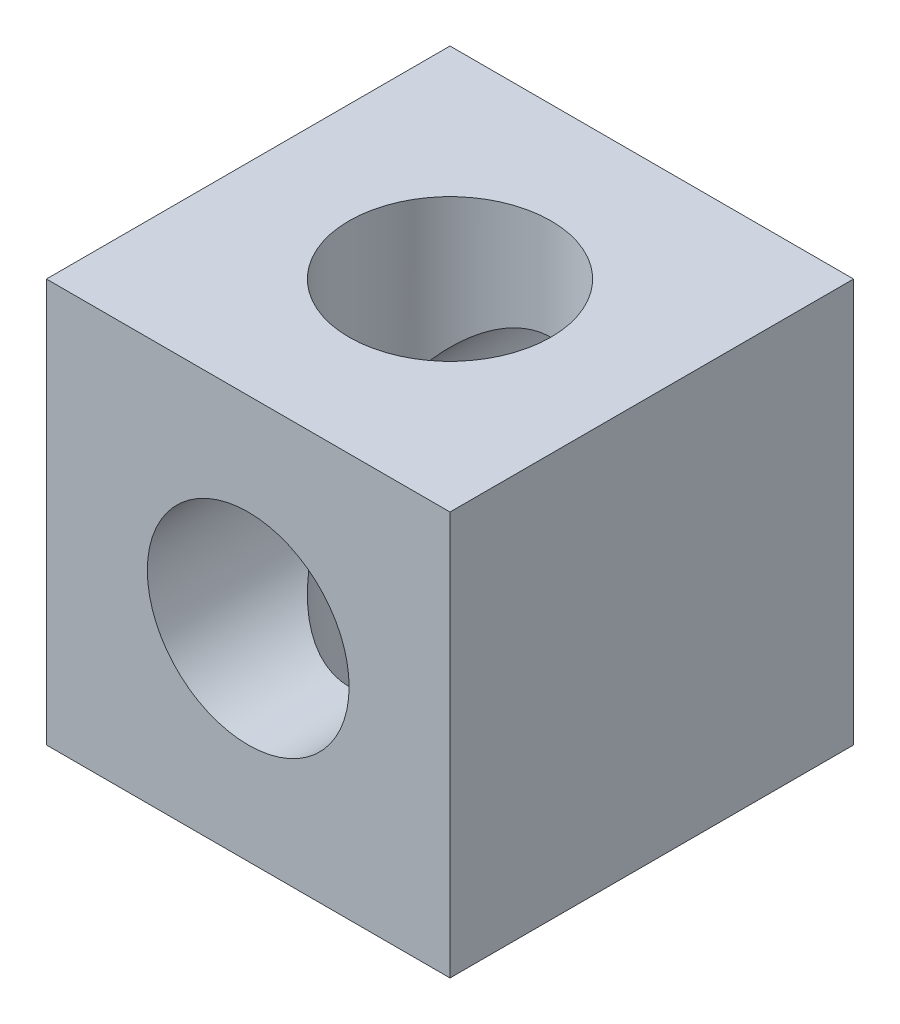
ISO-10303-21;
HEADER;
FILE_DESCRIPTION(('STEP AP214'),'2;1');
FILE_NAME('part.step','',(''),(''),'','','');
FILE_SCHEMA(('AUTOMOTIVE_DESIGN { 1 0 10303 214 1 1 1 1 }'));
ENDSEC;
DATA;
#1=APPLICATION_CONTEXT('core data for automotive mechanical design processes');
#2=APPLICATION_PROTOCOL_DEFINITION('international standard','automotive_design',2000,#1);
#3=PRODUCT_CONTEXT('',#1,'mechanical');
#4=PRODUCT('Part','Part','',(#3));
#5=PRODUCT_RELATED_PRODUCT_CATEGORY('part','',(#4));
#6=PRODUCT_DEFINITION_FORMATION('','',#4);
#7=PRODUCT_DEFINITION_CONTEXT('part definition',#1,'design');
#8=PRODUCT_DEFINITION('design','',#6,#7);
#9=PRODUCT_DEFINITION_SHAPE('','',#8);
#10=(LENGTH_UNIT() NAMED_UNIT(*) SI_UNIT(.MILLI.,.METRE.));
#11=(NAMED_UNIT(*) PLANE_ANGLE_UNIT() SI_UNIT($,.RADIAN.));
#12=(NAMED_UNIT(*) SI_UNIT($,.STERADIAN.) SOLID_ANGLE_UNIT());
#13=UNCERTAINTY_MEASURE_WITH_UNIT(LENGTH_MEASURE(1.E-05),#10,'distance_accuracy_value','');
#14=(GEOMETRIC_REPRESENTATION_CONTEXT(3) GLOBAL_UNCERTAINTY_ASSIGNED_CONTEXT((#13)) GLOBAL_UNIT_ASSIGNED_CONTEXT((#10,
#11,#12)) REPRESENTATION_CONTEXT('',''));
#15=CARTESIAN_POINT('',(0.,0.,0.));
#16=DIRECTION('',(0.,0.,1.));
#17=DIRECTION('',(1.,0.,0.));
#18=AXIS2_PLACEMENT_3D('',#15,#16,#17);
#19=CARTESIAN_POINT('',(4.02455846426619E-12,-3.19189119579733E-13,9.99999999999524));
#20=DIRECTION('',(0.,0.,-1.));
#21=DIRECTION('',(-1.,0.,0.));
#22=AXIS2_PLACEMENT_3D('',#19,#20,#21);
#23=CYLINDRICAL_SURFACE('',#22,2.5);
#24=CARTESIAN_POINT('',(4.44089209850063E-13,0.,4.99999999999606));
#25=DIRECTION('',(0.,0.707106781186548,-0.707106781186552));
#26=DIRECTION('',(0.,-0.707106781186548,-0.707106781186556));
#27=AXIS2_PLACEMENT_3D('',#24,#25,#26);
#28=ELLIPSE('',#27,3.53553390593274,2.5);
#29=CARTESIAN_POINT('',(2.50000000000128,3.33066907387547E-13,4.99999999999606));
#30=VERTEX_POINT('',#29);
#31=CARTESIAN_POINT('',(-2.49999999999792,-1.12410081243297E-12,4.99999999999567));
#32=VERTEX_POINT('',#31);
#33=EDGE_CURVE('E11',#30,#32,#28,.F.);
#34=ORIENTED_EDGE('',*,*,#33,.F.);
#35=CARTESIAN_POINT('',(4.44089209850063E-13,0.,4.99999999999606));
#36=DIRECTION('',(0.,-0.707106781186548,-0.707106781186556));
#37=DIRECTION('',(0.,0.707106781186548,-0.707106781186552));
#38=AXIS2_PLACEMENT_3D('',#35,#36,#37);
#39=ELLIPSE('',#38,3.53553390593274,2.5);
#40=EDGE_CURVE('E30',#32,#30,#39,.F.);
#41=ORIENTED_EDGE('',*,*,#40,.F.);
#42=EDGE_LOOP('',(#34,#41));
#43=FACE_BOUND('',#42,.T.);
#44=CARTESIAN_POINT('',(4.02455846426619E-12,-3.19189119579733E-13,9.99999999999524));
#45=DIRECTION('',(0.,0.,1.));
#46=DIRECTION('',(1.,0.,0.));
#47=AXIS2_PLACEMENT_3D('',#44,#45,#46);
#48=CIRCLE('',#47,2.5);
#49=CARTESIAN_POINT('',(2.50000000000402,-3.26544347117874E-13,9.99999999999524));
#50=VERTEX_POINT('',#49);
#51=EDGE_CURVE('E106',#50,#50,#48,.T.);
#52=ORIENTED_EDGE('',*,*,#51,.T.);
#53=EDGE_LOOP('',(#52));
#54=FACE_BOUND('',#53,.T.);
#55=ADVANCED_FACE('F16',(#43,#54),#23,.F.);
#56=CARTESIAN_POINT('',(-4.99999999999942,-5.00000000000057,9.99999999999634));
#57=DIRECTION('',(0.,0.,-1.));
#58=DIRECTION('',(-1.,0.,0.));
#59=AXIS2_PLACEMENT_3D('',#56,#57,#58);
#60=PLANE('',#59);
#61=DIRECTION('',(0.,-1.,0.));
#62=VECTOR('',#61,1.);
#63=CARTESIAN_POINT('',(-4.99999999999942,-5.00000000000057,9.99999999999634));
#64=LINE('',#63,#62);
#65=CARTESIAN_POINT('',(-4.99999999999984,5.00000000000015,9.99999999999995));
#66=VERTEX_POINT('',#65);
#67=CARTESIAN_POINT('',(-4.99999999999942,-5.00000000000057,9.99999999999634));
#68=VERTEX_POINT('',#67);
#69=EDGE_CURVE('E95',#66,#68,#64,.T.);
#70=ORIENTED_EDGE('',*,*,#69,.T.);
#71=DIRECTION('',(1.,0.,0.));
#72=VECTOR('',#71,1.);
#73=CARTESIAN_POINT('',(-4.99999999999942,-5.00000000000057,9.99999999999634));
#74=LINE('',#73,#72);
#75=CARTESIAN_POINT('',(5.00000000000544,-5.00000000000136,9.99999999999524));
#76=VERTEX_POINT('',#75);
#77=EDGE_CURVE('E93',#68,#76,#74,.T.);
#78=ORIENTED_EDGE('',*,*,#77,.T.);
#79=DIRECTION('',(0.,1.,0.));
#80=VECTOR('',#79,1.);
#81=CARTESIAN_POINT('',(5.00000000000544,-5.00000000000136,9.99999999999524));
#82=LINE('',#81,#80);
#83=CARTESIAN_POINT('',(5.00000000000088,4.99999999999867,9.9999999999984));
#84=VERTEX_POINT('',#83);
#85=EDGE_CURVE('E91',#76,#84,#82,.T.);
#86=ORIENTED_EDGE('',*,*,#85,.T.);
#87=DIRECTION('',(-1.,0.,0.));
#88=VECTOR('',#87,1.);
#89=CARTESIAN_POINT('',(-4.99999999999984,5.00000000000015,9.99999999999995));
#90=LINE('',#89,#88);
#91=EDGE_CURVE('E38',#84,#66,#90,.T.);
#92=ORIENTED_EDGE('',*,*,#91,.T.);
#93=EDGE_LOOP('',(#70,#78,#86,#92));
#94=FACE_BOUND('',#93,.T.);
#95=ORIENTED_EDGE('',*,*,#51,.F.);
#96=EDGE_LOOP('',(#95));
#97=FACE_BOUND('',#96,.T.);
#98=ADVANCED_FACE('F138',(#94,#97),#60,.F.);
#99=CARTESIAN_POINT('',(-4.99999999999634,-5.00000000000129,-6.7168492989822E-12));
#100=DIRECTION('',(0.,0.,-1.));
#101=DIRECTION('',(-1.,0.,0.));
#102=AXIS2_PLACEMENT_3D('',#99,#100,#101);
#103=PLANE('',#102);
#104=DIRECTION('',(0.,-1.,0.));
#105=VECTOR('',#104,1.);
#106=CARTESIAN_POINT('',(-4.99999999999634,-5.00000000000129,-6.7168492989822E-12));
#107=LINE('',#106,#105);
#108=CARTESIAN_POINT('',(-4.99999999999987,4.99999999999989,-3.60822483003176E-12));
#109=VERTEX_POINT('',#108);
#110=CARTESIAN_POINT('',(-4.99999999999634,-5.00000000000129,-6.7168492989822E-12));
#111=VERTEX_POINT('',#110);
#112=EDGE_CURVE('E103',#109,#111,#107,.T.);
#113=ORIENTED_EDGE('',*,*,#112,.F.);
#114=DIRECTION('',(-1.,0.,0.));
#115=VECTOR('',#114,1.);
#116=CARTESIAN_POINT('',(-4.99999999999987,4.99999999999989,-3.60822483003176E-12));
#117=LINE('',#116,#115);
#118=CARTESIAN_POINT('',(5.00000000000034,4.99999999999996,-3.77475828372553E-12));
#119=VERTEX_POINT('',#118);
#120=EDGE_CURVE('E97',#119,#109,#117,.T.);
#121=ORIENTED_EDGE('',*,*,#120,.F.);
#122=DIRECTION('',(0.,1.,0.));
#123=VECTOR('',#122,1.);
#124=CARTESIAN_POINT('',(5.00000000000189,-4.99999999999962,-6.55031584528842E-12));
#125=LINE('',#124,#123);
#126=CARTESIAN_POINT('',(5.00000000000189,-4.99999999999962,-6.55031584528842E-12));
#127=VERTEX_POINT('',#126);
#128=EDGE_CURVE('E99',#127,#119,#125,.T.);
#129=ORIENTED_EDGE('',*,*,#128,.F.);
#130=DIRECTION('',(1.,0.,0.));
#131=VECTOR('',#130,1.);
#132=CARTESIAN_POINT('',(-4.99999999999634,-5.00000000000129,-6.7168492989822E-12));
#133=LINE('',#132,#131);
#134=EDGE_CURVE('E101',#111,#127,#133,.T.);
#135=ORIENTED_EDGE('',*,*,#134,.F.);
#136=EDGE_LOOP('',(#113,#121,#129,#135));
#137=FACE_BOUND('',#136,.T.);
#138=CARTESIAN_POINT('',(0.,-3.2612801348364E-13,-3.88578058618805E-13));
#139=DIRECTION('',(0.,0.,1.));
#140=DIRECTION('',(1.,0.,0.));
#141=AXIS2_PLACEMENT_3D('',#138,#139,#140);
#142=CIRCLE('',#141,2.5);
#143=CARTESIAN_POINT('',(2.5,-3.33483241021781E-13,-3.86177635008922E-13));
#144=VERTEX_POINT('',#143);
#145=EDGE_CURVE('E109',#144,#144,#142,.T.);
#146=ORIENTED_EDGE('',*,*,#145,.T.);
#147=EDGE_LOOP('',(#146));
#148=FACE_BOUND('',#147,.T.);
#149=ADVANCED_FACE('F132',(#137,#148),#103,.T.);
#150=CARTESIAN_POINT('',(-4.99999999999942,-5.00000000000057,9.99999999999634));
#151=DIRECTION('',(1.,0.,0.));
#152=DIRECTION('',(0.,0.,-1.));
#153=AXIS2_PLACEMENT_3D('',#150,#151,#152);
#154=PLANE('',#153);
#155=ORIENTED_EDGE('',*,*,#112,.T.);
#156=DIRECTION('',(0.,0.,-1.));
#157=VECTOR('',#156,1.);
#158=CARTESIAN_POINT('',(-4.99999999999942,-5.00000000000057,9.99999999999634));
#159=LINE('',#158,#157);
#160=EDGE_CURVE('E73',#68,#111,#159,.T.);
#161=ORIENTED_EDGE('',*,*,#160,.F.);
#162=ORIENTED_EDGE('',*,*,#69,.F.);
#163=DIRECTION('',(0.,0.,-1.));
#164=VECTOR('',#163,1.);
#165=CARTESIAN_POINT('',(-4.99999999999984,5.00000000000015,9.99999999999995));
#166=LINE('',#165,#164);
#167=EDGE_CURVE('E87',#66,#109,#166,.T.);
#168=ORIENTED_EDGE('',*,*,#167,.T.);
#169=EDGE_LOOP('',(#155,#161,#162,#168));
#170=FACE_BOUND('',#169,.T.);
#171=ADVANCED_FACE('F18',(#170),#154,.F.);
#172=CARTESIAN_POINT('',(-4.99999999999942,-5.00000000000057,9.99999999999634));
#173=DIRECTION('',(0.,1.,0.));
#174=DIRECTION('',(0.,0.,1.));
#175=AXIS2_PLACEMENT_3D('',#172,#173,#174);
#176=PLANE('',#175);
#177=CARTESIAN_POINT('',(2.44249065417534E-12,-5.00000000000061,4.99999999999518));
#178=DIRECTION('',(0.,1.,0.));
#179=DIRECTION('',(0.,0.,1.));
#180=AXIS2_PLACEMENT_3D('',#177,#178,#179);
#181=CIRCLE('',#180,2.5);
#182=CARTESIAN_POINT('',(2.4395863476058E-12,-5.00000000000061,7.49999999999518));
#183=VERTEX_POINT('',#182);
#184=EDGE_CURVE('E112',#183,#183,#181,.T.);
#185=ORIENTED_EDGE('',*,*,#184,.T.);
#186=EDGE_LOOP('',(#185));
#187=FACE_BOUND('',#186,.T.);
#188=ORIENTED_EDGE('',*,*,#134,.T.);
#189=DIRECTION('',(0.,0.,-1.));
#190=VECTOR('',#189,1.);
#191=CARTESIAN_POINT('',(5.00000000000544,-5.00000000000136,9.99999999999524));
#192=LINE('',#191,#190);
#193=EDGE_CURVE('E81',#76,#127,#192,.T.);
#194=ORIENTED_EDGE('',*,*,#193,.F.);
#195=ORIENTED_EDGE('',*,*,#77,.F.);
#196=ORIENTED_EDGE('',*,*,#160,.T.);
#197=EDGE_LOOP('',(#188,#194,#195,#196));
#198=FACE_BOUND('',#197,.T.);
#199=ADVANCED_FACE('F136',(#187,#198),#176,.F.);
#200=CARTESIAN_POINT('',(5.00000000000544,-5.00000000000136,9.99999999999524));
#201=DIRECTION('',(-1.,0.,0.));
#202=DIRECTION('',(0.,0.,1.));
#203=AXIS2_PLACEMENT_3D('',#200,#201,#202);
#204=PLANE('',#203);
#205=ORIENTED_EDGE('',*,*,#128,.T.);
#206=DIRECTION('',(0.,0.,-1.));
#207=VECTOR('',#206,1.);
#208=CARTESIAN_POINT('',(5.00000000000088,4.99999999999867,9.9999999999984));
#209=LINE('',#208,#207);
#210=EDGE_CURVE('E84',#84,#119,#209,.T.);
#211=ORIENTED_EDGE('',*,*,#210,.F.);
#212=ORIENTED_EDGE('',*,*,#85,.F.);
#213=ORIENTED_EDGE('',*,*,#193,.T.);
#214=EDGE_LOOP('',(#205,#211,#212,#213));
#215=FACE_BOUND('',#214,.T.);
#216=ADVANCED_FACE('F122',(#215),#204,.F.);
#217=CARTESIAN_POINT('',(-4.99999999999984,5.00000000000015,9.99999999999995));
#218=DIRECTION('',(0.,-1.,0.));
#219=DIRECTION('',(1.,0.,0.));
#220=AXIS2_PLACEMENT_3D('',#217,#218,#219);
#221=PLANE('',#220);
#222=CARTESIAN_POINT('',(0.,5.00000000000008,4.99999999999984));
#223=DIRECTION('',(0.,1.,0.));
#224=DIRECTION('',(0.,0.,1.));
#225=AXIS2_PLACEMENT_3D('',#222,#223,#224);
#226=CIRCLE('',#225,2.5);
#227=CARTESIAN_POINT('',(0.,5.00000000000008,7.49999999999984));
#228=VERTEX_POINT('',#227);
#229=EDGE_CURVE('E115',#228,#228,#226,.T.);
#230=ORIENTED_EDGE('',*,*,#229,.F.);
#231=EDGE_LOOP('',(#230));
#232=FACE_BOUND('',#231,.T.);
#233=ORIENTED_EDGE('',*,*,#120,.T.);
#234=ORIENTED_EDGE('',*,*,#167,.F.);
#235=ORIENTED_EDGE('',*,*,#91,.F.);
#236=ORIENTED_EDGE('',*,*,#210,.T.);
#237=EDGE_LOOP('',(#233,#234,#235,#236));
#238=FACE_BOUND('',#237,.T.);
#239=ADVANCED_FACE('F119',(#232,#238),#221,.F.);
#240=CARTESIAN_POINT('',(4.44089209850063E-13,0.,4.99999999999606));
#241=DIRECTION('',(0.,0.707106781186548,-0.707106781186552));
#242=DIRECTION('',(0.,-0.707106781186548,-0.707106781186556));
#243=AXIS2_PLACEMENT_3D('',#240,#241,#242);
#244=ELLIPSE('',#243,3.53553390593274,2.5);
#245=EDGE_CURVE('E24',#30,#32,#244,.T.);
#246=ORIENTED_EDGE('',*,*,#245,.F.);
#247=CARTESIAN_POINT('',(4.44089209850063E-13,0.,4.99999999999606));
#248=DIRECTION('',(0.,-0.707106781186548,-0.707106781186556));
#249=DIRECTION('',(0.,0.707106781186548,-0.707106781186552));
#250=AXIS2_PLACEMENT_3D('',#247,#248,#249);
#251=ELLIPSE('',#250,3.53553390593274,2.5);
#252=EDGE_CURVE('E64',#32,#30,#251,.T.);
#253=ORIENTED_EDGE('',*,*,#252,.F.);
#254=EDGE_LOOP('',(#246,#253));
#255=FACE_BOUND('',#254,.T.);
#256=ORIENTED_EDGE('',*,*,#145,.F.);
#257=EDGE_LOOP('',(#256));
#258=FACE_BOUND('',#257,.T.);
#259=ADVANCED_FACE('F76',(#255,#258),#23,.F.);
#260=CARTESIAN_POINT('',(2.44249065417534E-12,-5.00000000000061,4.99999999999518));
#261=DIRECTION('',(0.,1.,0.));
#262=DIRECTION('',(0.,0.,1.));
#263=AXIS2_PLACEMENT_3D('',#260,#261,#262);
#264=CYLINDRICAL_SURFACE('',#263,2.5);
#265=ORIENTED_EDGE('',*,*,#245,.T.);
#266=ORIENTED_EDGE('',*,*,#40,.T.);
#267=EDGE_LOOP('',(#265,#266));
#268=FACE_BOUND('',#267,.T.);
#269=ORIENTED_EDGE('',*,*,#184,.F.);
#270=EDGE_LOOP('',(#269));
#271=FACE_BOUND('',#270,.T.);
#272=ADVANCED_FACE('F71',(#268,#271),#264,.F.);
#273=ORIENTED_EDGE('',*,*,#33,.T.);
#274=ORIENTED_EDGE('',*,*,#252,.T.);
#275=EDGE_LOOP('',(#273,#274));
#276=FACE_BOUND('',#275,.T.);
#277=ORIENTED_EDGE('',*,*,#229,.T.);
#278=EDGE_LOOP('',(#277));
#279=FACE_BOUND('',#278,.T.);
#280=ADVANCED_FACE('F65',(#276,#279),#264,.F.);
#281=CLOSED_SHELL('',(#55,#98,#149,#171,#199,#216,#239,#259,#272,#280));
#282=MANIFOLD_SOLID_BREP('B1',#281);
#283=ADVANCED_BREP_SHAPE_REPRESENTATION('',(#18,#282),#14);
#284=SHAPE_DEFINITION_REPRESENTATION(#9,#283);
ENDSEC;
END-ISO-10303-21;
